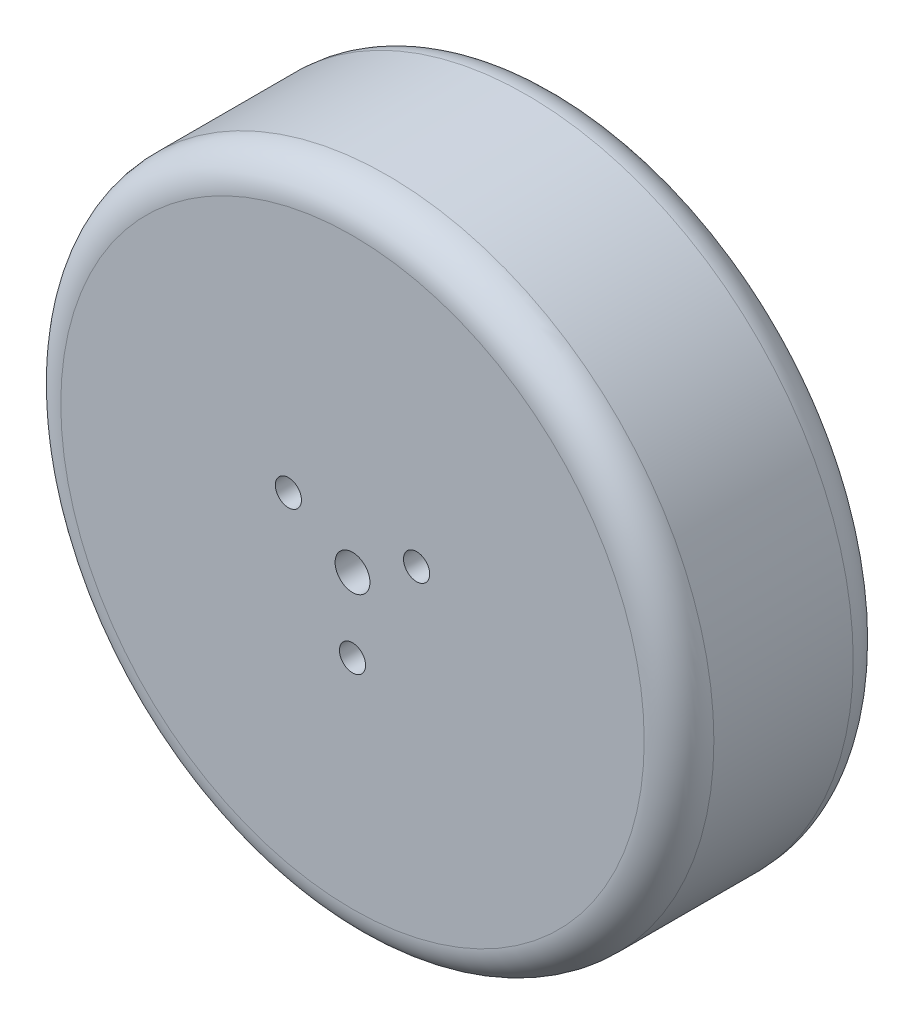
ISO-10303-21;
HEADER;
FILE_DESCRIPTION(('STEP AP214'),'2;1');
FILE_NAME('part.step','',(''),(''),'','','');
FILE_SCHEMA(('AUTOMOTIVE_DESIGN { 1 0 10303 214 1 1 1 1 }'));
ENDSEC;
DATA;
#1=APPLICATION_CONTEXT('core data for automotive mechanical design processes');
#2=APPLICATION_PROTOCOL_DEFINITION('international standard','automotive_design',2000,#1);
#3=PRODUCT_CONTEXT('',#1,'mechanical');
#4=PRODUCT('Part','Part','',(#3));
#5=PRODUCT_RELATED_PRODUCT_CATEGORY('part','',(#4));
#6=PRODUCT_DEFINITION_FORMATION('','',#4);
#7=PRODUCT_DEFINITION_CONTEXT('part definition',#1,'design');
#8=PRODUCT_DEFINITION('design','',#6,#7);
#9=PRODUCT_DEFINITION_SHAPE('','',#8);
#10=(LENGTH_UNIT() NAMED_UNIT(*) SI_UNIT(.MILLI.,.METRE.));
#11=(NAMED_UNIT(*) PLANE_ANGLE_UNIT() SI_UNIT($,.RADIAN.));
#12=(NAMED_UNIT(*) SI_UNIT($,.STERADIAN.) SOLID_ANGLE_UNIT());
#13=UNCERTAINTY_MEASURE_WITH_UNIT(LENGTH_MEASURE(1.E-05),#10,'distance_accuracy_value','');
#14=(GEOMETRIC_REPRESENTATION_CONTEXT(3) GLOBAL_UNCERTAINTY_ASSIGNED_CONTEXT((#13)) GLOBAL_UNIT_ASSIGNED_CONTEXT((#10,
#11,#12)) REPRESENTATION_CONTEXT('',''));
#15=CARTESIAN_POINT('',(0.,0.,0.));
#16=DIRECTION('',(0.,0.,1.));
#17=DIRECTION('',(1.,0.,0.));
#18=AXIS2_PLACEMENT_3D('',#15,#16,#17);
#19=CARTESIAN_POINT('',(0.,0.,24.));
#20=DIRECTION('',(0.,0.,-1.));
#21=DIRECTION('',(-1.,0.,0.));
#22=AXIS2_PLACEMENT_3D('',#19,#20,#21);
#23=CYLINDRICAL_SURFACE('',#22,37.5);
#24=CARTESIAN_POINT('',(0.,0.,4.));
#25=DIRECTION('',(0.,0.,1.));
#26=DIRECTION('',(1.,0.,0.));
#27=AXIS2_PLACEMENT_3D('',#24,#25,#26);
#28=CIRCLE('',#27,37.5);
#29=CARTESIAN_POINT('',(37.5,0.,4.));
#30=VERTEX_POINT('',#29);
#31=EDGE_CURVE('E42',#30,#30,#28,.T.);
#32=ORIENTED_EDGE('',*,*,#31,.T.);
#33=EDGE_LOOP('',(#32));
#34=FACE_BOUND('',#33,.T.);
#35=CARTESIAN_POINT('',(0.,0.,20.));
#36=DIRECTION('',(0.,0.,1.));
#37=DIRECTION('',(1.,0.,0.));
#38=AXIS2_PLACEMENT_3D('',#35,#36,#37);
#39=CIRCLE('',#38,37.5);
#40=CARTESIAN_POINT('',(37.5,0.,20.));
#41=VERTEX_POINT('',#40);
#42=EDGE_CURVE('E46',#41,#41,#39,.F.);
#43=ORIENTED_EDGE('',*,*,#42,.T.);
#44=EDGE_LOOP('',(#43));
#45=FACE_BOUND('',#44,.T.);
#46=ADVANCED_FACE('F31',(#34,#45),#23,.T.);
#47=CARTESIAN_POINT('',(0.,0.,24.));
#48=DIRECTION('',(0.,0.,1.));
#49=DIRECTION('',(1.,0.,0.));
#50=AXIS2_PLACEMENT_3D('',#47,#48,#49);
#51=PLANE('',#50);
#52=CARTESIAN_POINT('',(7.36121593216771,4.25000000000004,24.));
#53=DIRECTION('',(0.,0.,1.));
#54=DIRECTION('',(-0.500000000000004,0.866025403784436,0.));
#55=AXIS2_PLACEMENT_3D('',#52,#53,#54);
#56=CIRCLE('',#55,1.5);
#57=CARTESIAN_POINT('',(6.6112159321677,5.5490381056767,24.));
#58=VERTEX_POINT('',#57);
#59=EDGE_CURVE('E70',#58,#58,#56,.T.);
#60=ORIENTED_EDGE('',*,*,#59,.F.);
#61=EDGE_LOOP('',(#60));
#62=FACE_BOUND('',#61,.T.);
#63=CARTESIAN_POINT('',(-7.36121593216777,4.24999999999993,24.));
#64=DIRECTION('',(0.,0.,1.));
#65=DIRECTION('',(-0.499999999999992,-0.866025403784443,0.));
#66=AXIS2_PLACEMENT_3D('',#63,#64,#65);
#67=CIRCLE('',#66,1.5);
#68=CARTESIAN_POINT('',(-8.11121593216776,2.95096189432326,24.));
#69=VERTEX_POINT('',#68);
#70=EDGE_CURVE('E64',#69,#69,#67,.T.);
#71=ORIENTED_EDGE('',*,*,#70,.F.);
#72=EDGE_LOOP('',(#71));
#73=FACE_BOUND('',#72,.T.);
#74=CARTESIAN_POINT('',(0.,-8.5,24.));
#75=DIRECTION('',(0.,0.,1.));
#76=DIRECTION('',(1.,0.,0.));
#77=AXIS2_PLACEMENT_3D('',#74,#75,#76);
#78=CIRCLE('',#77,1.5);
#79=CARTESIAN_POINT('',(1.50000000000001,-8.5,24.));
#80=VERTEX_POINT('',#79);
#81=EDGE_CURVE('E58',#80,#80,#78,.T.);
#82=ORIENTED_EDGE('',*,*,#81,.F.);
#83=EDGE_LOOP('',(#82));
#84=FACE_BOUND('',#83,.T.);
#85=CARTESIAN_POINT('',(0.,0.,24.));
#86=DIRECTION('',(0.,0.,1.));
#87=DIRECTION('',(1.,0.,0.));
#88=AXIS2_PLACEMENT_3D('',#85,#86,#87);
#89=CIRCLE('',#88,2.);
#90=CARTESIAN_POINT('',(2.,0.,24.));
#91=VERTEX_POINT('',#90);
#92=EDGE_CURVE('E52',#91,#91,#89,.T.);
#93=ORIENTED_EDGE('',*,*,#92,.F.);
#94=EDGE_LOOP('',(#93));
#95=FACE_BOUND('',#94,.T.);
#96=CARTESIAN_POINT('',(0.,0.,24.));
#97=DIRECTION('',(0.,0.,1.));
#98=DIRECTION('',(1.,0.,0.));
#99=AXIS2_PLACEMENT_3D('',#96,#97,#98);
#100=CIRCLE('',#99,33.5);
#101=CARTESIAN_POINT('',(33.5,0.,24.));
#102=VERTEX_POINT('',#101);
#103=EDGE_CURVE('E10',#102,#102,#100,.T.);
#104=ORIENTED_EDGE('',*,*,#103,.T.);
#105=EDGE_LOOP('',(#104));
#106=FACE_BOUND('',#105,.T.);
#107=ADVANCED_FACE('F86',(#62,#73,#84,#95,#106),#51,.T.);
#108=CARTESIAN_POINT('',(0.,0.,0.));
#109=DIRECTION('',(0.,0.,1.));
#110=DIRECTION('',(1.,0.,0.));
#111=AXIS2_PLACEMENT_3D('',#108,#109,#110);
#112=PLANE('',#111);
#113=CARTESIAN_POINT('',(7.36121593216771,4.25000000000004,0.));
#114=DIRECTION('',(0.,0.,1.));
#115=DIRECTION('',(-0.500000000000004,0.866025403784436,0.));
#116=AXIS2_PLACEMENT_3D('',#113,#114,#115);
#117=CIRCLE('',#116,1.5);
#118=CARTESIAN_POINT('',(6.6112159321677,5.5490381056767,0.));
#119=VERTEX_POINT('',#118);
#120=EDGE_CURVE('E61',#119,#119,#117,.T.);
#121=ORIENTED_EDGE('',*,*,#120,.T.);
#122=EDGE_LOOP('',(#121));
#123=FACE_BOUND('',#122,.T.);
#124=CARTESIAN_POINT('',(-7.36121593216777,4.24999999999993,0.));
#125=DIRECTION('',(0.,0.,1.));
#126=DIRECTION('',(-0.499999999999992,-0.866025403784443,0.));
#127=AXIS2_PLACEMENT_3D('',#124,#125,#126);
#128=CIRCLE('',#127,1.5);
#129=CARTESIAN_POINT('',(-8.11121593216776,2.95096189432326,0.));
#130=VERTEX_POINT('',#129);
#131=EDGE_CURVE('E67',#130,#130,#128,.T.);
#132=ORIENTED_EDGE('',*,*,#131,.T.);
#133=EDGE_LOOP('',(#132));
#134=FACE_BOUND('',#133,.T.);
#135=CARTESIAN_POINT('',(0.,-8.5,0.));
#136=DIRECTION('',(0.,0.,1.));
#137=DIRECTION('',(1.,0.,0.));
#138=AXIS2_PLACEMENT_3D('',#135,#136,#137);
#139=CIRCLE('',#138,1.5);
#140=CARTESIAN_POINT('',(1.50000000000001,-8.5,0.));
#141=VERTEX_POINT('',#140);
#142=EDGE_CURVE('E55',#141,#141,#139,.T.);
#143=ORIENTED_EDGE('',*,*,#142,.T.);
#144=EDGE_LOOP('',(#143));
#145=FACE_BOUND('',#144,.T.);
#146=CARTESIAN_POINT('',(0.,0.,0.));
#147=DIRECTION('',(0.,0.,1.));
#148=DIRECTION('',(1.,0.,0.));
#149=AXIS2_PLACEMENT_3D('',#146,#147,#148);
#150=CIRCLE('',#149,2.);
#151=CARTESIAN_POINT('',(2.,0.,0.));
#152=VERTEX_POINT('',#151);
#153=EDGE_CURVE('E51',#152,#152,#150,.T.);
#154=ORIENTED_EDGE('',*,*,#153,.T.);
#155=EDGE_LOOP('',(#154));
#156=FACE_BOUND('',#155,.T.);
#157=CARTESIAN_POINT('',(0.,0.,0.));
#158=DIRECTION('',(0.,0.,1.));
#159=DIRECTION('',(1.,0.,0.));
#160=AXIS2_PLACEMENT_3D('',#157,#158,#159);
#161=CIRCLE('',#160,33.5);
#162=CARTESIAN_POINT('',(33.5,0.,0.));
#163=VERTEX_POINT('',#162);
#164=EDGE_CURVE('E38',#163,#163,#161,.F.);
#165=ORIENTED_EDGE('',*,*,#164,.T.);
#166=EDGE_LOOP('',(#165));
#167=FACE_BOUND('',#166,.T.);
#168=ADVANCED_FACE('F76',(#123,#134,#145,#156,#167),#112,.F.);
#169=CARTESIAN_POINT('',(0.,0.,4.));
#170=DIRECTION('',(0.,0.,1.));
#171=DIRECTION('',(1.,0.,0.));
#172=AXIS2_PLACEMENT_3D('',#169,#170,#171);
#173=TOROIDAL_SURFACE('',#172,33.5,4.);
#174=ORIENTED_EDGE('',*,*,#164,.F.);
#175=EDGE_LOOP('',(#174));
#176=FACE_BOUND('',#175,.T.);
#177=ORIENTED_EDGE('',*,*,#31,.F.);
#178=EDGE_LOOP('',(#177));
#179=FACE_BOUND('',#178,.T.);
#180=ADVANCED_FACE('F107',(#176,#179),#173,.T.);
#181=CARTESIAN_POINT('',(0.,0.,20.));
#182=DIRECTION('',(0.,0.,1.));
#183=DIRECTION('',(1.,0.,0.));
#184=AXIS2_PLACEMENT_3D('',#181,#182,#183);
#185=TOROIDAL_SURFACE('',#184,33.5,4.);
#186=ORIENTED_EDGE('',*,*,#42,.F.);
#187=EDGE_LOOP('',(#186));
#188=FACE_BOUND('',#187,.T.);
#189=ORIENTED_EDGE('',*,*,#103,.F.);
#190=EDGE_LOOP('',(#189));
#191=FACE_BOUND('',#190,.T.);
#192=ADVANCED_FACE('F33',(#188,#191),#185,.T.);
#193=CARTESIAN_POINT('',(0.,0.,0.));
#194=DIRECTION('',(0.,0.,1.));
#195=DIRECTION('',(1.,0.,0.));
#196=AXIS2_PLACEMENT_3D('',#193,#194,#195);
#197=CYLINDRICAL_SURFACE('',#196,2.);
#198=ORIENTED_EDGE('',*,*,#153,.F.);
#199=EDGE_LOOP('',(#198));
#200=FACE_BOUND('',#199,.T.);
#201=ORIENTED_EDGE('',*,*,#92,.T.);
#202=EDGE_LOOP('',(#201));
#203=FACE_BOUND('',#202,.T.);
#204=ADVANCED_FACE('F96',(#200,#203),#197,.F.);
#205=CARTESIAN_POINT('',(0.,-8.5,0.));
#206=DIRECTION('',(0.,0.,1.));
#207=DIRECTION('',(1.,0.,0.));
#208=AXIS2_PLACEMENT_3D('',#205,#206,#207);
#209=CYLINDRICAL_SURFACE('',#208,1.5);
#210=ORIENTED_EDGE('',*,*,#142,.F.);
#211=EDGE_LOOP('',(#210));
#212=FACE_BOUND('',#211,.T.);
#213=ORIENTED_EDGE('',*,*,#81,.T.);
#214=EDGE_LOOP('',(#213));
#215=FACE_BOUND('',#214,.T.);
#216=ADVANCED_FACE('F98',(#212,#215),#209,.F.);
#217=CARTESIAN_POINT('',(-7.36121593216777,4.24999999999993,0.));
#218=DIRECTION('',(0.,0.,1.));
#219=DIRECTION('',(1.,0.,0.));
#220=AXIS2_PLACEMENT_3D('',#217,#218,#219);
#221=CYLINDRICAL_SURFACE('',#220,1.5);
#222=ORIENTED_EDGE('',*,*,#131,.F.);
#223=EDGE_LOOP('',(#222));
#224=FACE_BOUND('',#223,.T.);
#225=ORIENTED_EDGE('',*,*,#70,.T.);
#226=EDGE_LOOP('',(#225));
#227=FACE_BOUND('',#226,.T.);
#228=ADVANCED_FACE('F82',(#224,#227),#221,.F.);
#229=CARTESIAN_POINT('',(7.36121593216771,4.25000000000004,0.));
#230=DIRECTION('',(0.,0.,1.));
#231=DIRECTION('',(1.,0.,0.));
#232=AXIS2_PLACEMENT_3D('',#229,#230,#231);
#233=CYLINDRICAL_SURFACE('',#232,1.5);
#234=ORIENTED_EDGE('',*,*,#120,.F.);
#235=EDGE_LOOP('',(#234));
#236=FACE_BOUND('',#235,.T.);
#237=ORIENTED_EDGE('',*,*,#59,.T.);
#238=EDGE_LOOP('',(#237));
#239=FACE_BOUND('',#238,.T.);
#240=ADVANCED_FACE('F79',(#236,#239),#233,.F.);
#241=CLOSED_SHELL('',(#46,#107,#168,#180,#192,#204,#216,#228,#240));
#242=MANIFOLD_SOLID_BREP('B2',#241);
#243=ADVANCED_BREP_SHAPE_REPRESENTATION('',(#18,#242),#14);
#244=SHAPE_DEFINITION_REPRESENTATION(#9,#243);
ENDSEC;
END-ISO-10303-21;
